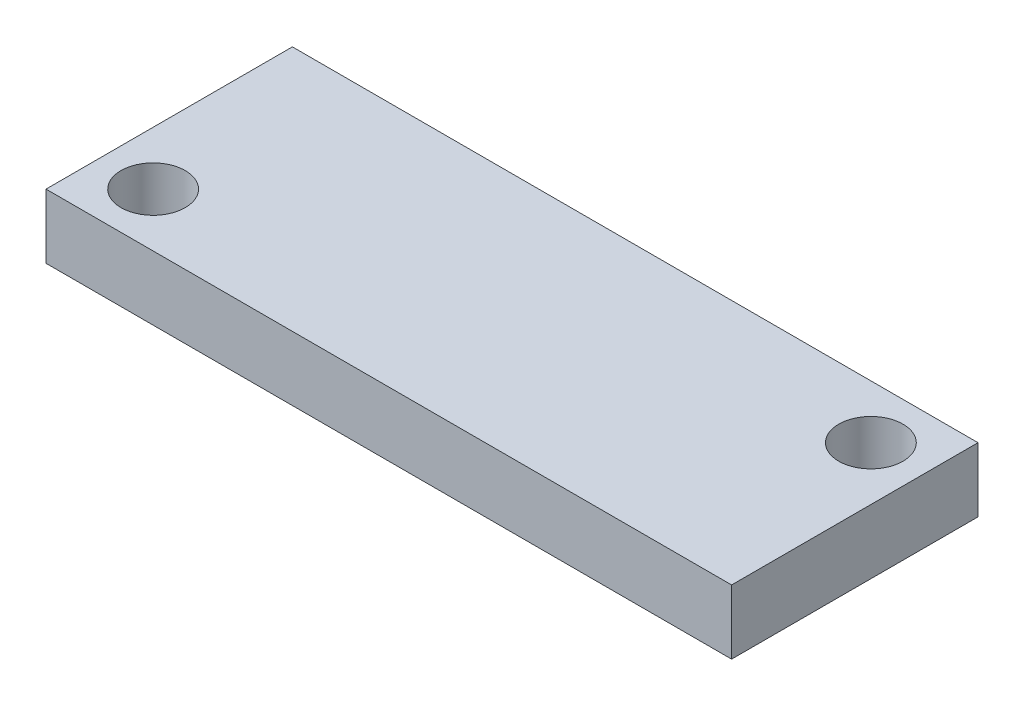
ISO-10303-21;
HEADER;
FILE_DESCRIPTION(('STEP AP214'),'2;1');
FILE_NAME('part.step','',(''),(''),'','','');
FILE_SCHEMA(('AUTOMOTIVE_DESIGN { 1 0 10303 214 1 1 1 1 }'));
ENDSEC;
DATA;
#1=APPLICATION_CONTEXT('core data for automotive mechanical design processes');
#2=APPLICATION_PROTOCOL_DEFINITION('international standard','automotive_design',2000,#1);
#3=PRODUCT_CONTEXT('',#1,'mechanical');
#4=PRODUCT('Part','Part','',(#3));
#5=PRODUCT_RELATED_PRODUCT_CATEGORY('part','',(#4));
#6=PRODUCT_DEFINITION_FORMATION('','',#4);
#7=PRODUCT_DEFINITION_CONTEXT('part definition',#1,'design');
#8=PRODUCT_DEFINITION('design','',#6,#7);
#9=PRODUCT_DEFINITION_SHAPE('','',#8);
#10=(LENGTH_UNIT() NAMED_UNIT(*) SI_UNIT(.MILLI.,.METRE.));
#11=(NAMED_UNIT(*) PLANE_ANGLE_UNIT() SI_UNIT($,.RADIAN.));
#12=(NAMED_UNIT(*) SI_UNIT($,.STERADIAN.) SOLID_ANGLE_UNIT());
#13=UNCERTAINTY_MEASURE_WITH_UNIT(LENGTH_MEASURE(1.E-05),#10,'distance_accuracy_value','');
#14=(GEOMETRIC_REPRESENTATION_CONTEXT(3) GLOBAL_UNCERTAINTY_ASSIGNED_CONTEXT((#13)) GLOBAL_UNIT_ASSIGNED_CONTEXT((#10,
#11,#12)) REPRESENTATION_CONTEXT('',''));
#15=CARTESIAN_POINT('',(0.,0.,0.));
#16=DIRECTION('',(0.,0.,1.));
#17=DIRECTION('',(1.,0.,0.));
#18=AXIS2_PLACEMENT_3D('',#15,#16,#17);
#19=CARTESIAN_POINT('',(0.,3.,0.));
#20=DIRECTION('',(0.,-1.,0.));
#21=DIRECTION('',(0.,0.,-1.));
#22=AXIS2_PLACEMENT_3D('',#19,#20,#21);
#23=PLANE('',#22);
#24=CARTESIAN_POINT('',(2.5,3.,-2.5));
#25=DIRECTION('',(0.,1.,0.));
#26=DIRECTION('',(0.,0.,1.));
#27=AXIS2_PLACEMENT_3D('',#24,#25,#26);
#28=CIRCLE('',#27,1.5);
#29=CARTESIAN_POINT('',(2.5,3.,-1.));
#30=VERTEX_POINT('',#29);
#31=EDGE_CURVE('E100',#30,#30,#28,.T.);
#32=ORIENTED_EDGE('',*,*,#31,.F.);
#33=EDGE_LOOP('',(#32));
#34=FACE_BOUND('',#33,.T.);
#35=DIRECTION('',(0.,0.,1.));
#36=VECTOR('',#35,1.);
#37=CARTESIAN_POINT('',(0.,3.,0.));
#38=LINE('',#37,#36);
#39=CARTESIAN_POINT('',(0.,3.,-11.5));
#40=VERTEX_POINT('',#39);
#41=CARTESIAN_POINT('',(0.,3.,0.));
#42=VERTEX_POINT('',#41);
#43=EDGE_CURVE('E85',#40,#42,#38,.T.);
#44=ORIENTED_EDGE('',*,*,#43,.T.);
#45=DIRECTION('',(1.,0.,0.));
#46=VECTOR('',#45,1.);
#47=CARTESIAN_POINT('',(0.,3.,0.));
#48=LINE('',#47,#46);
#49=CARTESIAN_POINT('',(32.,3.,0.));
#50=VERTEX_POINT('',#49);
#51=EDGE_CURVE('E80',#42,#50,#48,.T.);
#52=ORIENTED_EDGE('',*,*,#51,.T.);
#53=DIRECTION('',(0.,0.,-1.));
#54=VECTOR('',#53,1.);
#55=CARTESIAN_POINT('',(32.,3.,-11.5));
#56=LINE('',#55,#54);
#57=CARTESIAN_POINT('',(32.,3.,-11.5));
#58=VERTEX_POINT('',#57);
#59=EDGE_CURVE('E83',#50,#58,#56,.T.);
#60=ORIENTED_EDGE('',*,*,#59,.T.);
#61=DIRECTION('',(-1.,0.,0.));
#62=VECTOR('',#61,1.);
#63=CARTESIAN_POINT('',(0.,3.,-11.5));
#64=LINE('',#63,#62);
#65=EDGE_CURVE('E50',#58,#40,#64,.T.);
#66=ORIENTED_EDGE('',*,*,#65,.T.);
#67=EDGE_LOOP('',(#44,#52,#60,#66));
#68=FACE_BOUND('',#67,.T.);
#69=CARTESIAN_POINT('',(29.5,3.,-9.));
#70=DIRECTION('',(0.,1.,0.));
#71=DIRECTION('',(0.,0.,1.));
#72=AXIS2_PLACEMENT_3D('',#69,#70,#71);
#73=CIRCLE('',#72,1.5);
#74=CARTESIAN_POINT('',(29.5,3.,-7.5));
#75=VERTEX_POINT('',#74);
#76=EDGE_CURVE('E115',#75,#75,#73,.T.);
#77=ORIENTED_EDGE('',*,*,#76,.F.);
#78=EDGE_LOOP('',(#77));
#79=FACE_BOUND('',#78,.T.);
#80=ADVANCED_FACE('F33',(#34,#68,#79),#23,.F.);
#81=CARTESIAN_POINT('',(0.,0.,0.));
#82=DIRECTION('',(0.,-1.,0.));
#83=DIRECTION('',(0.,0.,-1.));
#84=AXIS2_PLACEMENT_3D('',#81,#82,#83);
#85=PLANE('',#84);
#86=CARTESIAN_POINT('',(2.5,0.,-2.5));
#87=DIRECTION('',(0.,1.,0.));
#88=DIRECTION('',(0.,0.,1.));
#89=AXIS2_PLACEMENT_3D('',#86,#87,#88);
#90=CIRCLE('',#89,1.5);
#91=CARTESIAN_POINT('',(2.5,0.,-1.));
#92=VERTEX_POINT('',#91);
#93=EDGE_CURVE('E112',#92,#92,#90,.T.);
#94=ORIENTED_EDGE('',*,*,#93,.T.);
#95=EDGE_LOOP('',(#94));
#96=FACE_BOUND('',#95,.T.);
#97=DIRECTION('',(0.,0.,1.));
#98=VECTOR('',#97,1.);
#99=CARTESIAN_POINT('',(0.,0.,0.));
#100=LINE('',#99,#98);
#101=CARTESIAN_POINT('',(0.,0.,-11.5));
#102=VERTEX_POINT('',#101);
#103=CARTESIAN_POINT('',(0.,0.,0.));
#104=VERTEX_POINT('',#103);
#105=EDGE_CURVE('E97',#102,#104,#100,.T.);
#106=ORIENTED_EDGE('',*,*,#105,.F.);
#107=DIRECTION('',(-1.,0.,0.));
#108=VECTOR('',#107,1.);
#109=CARTESIAN_POINT('',(0.,0.,-11.5));
#110=LINE('',#109,#108);
#111=CARTESIAN_POINT('',(32.,0.,-11.5));
#112=VERTEX_POINT('',#111);
#113=EDGE_CURVE('E73',#112,#102,#110,.T.);
#114=ORIENTED_EDGE('',*,*,#113,.F.);
#115=DIRECTION('',(0.,0.,-1.));
#116=VECTOR('',#115,1.);
#117=CARTESIAN_POINT('',(32.,0.,-11.5));
#118=LINE('',#117,#116);
#119=CARTESIAN_POINT('',(32.,0.,0.));
#120=VERTEX_POINT('',#119);
#121=EDGE_CURVE('E67',#120,#112,#118,.T.);
#122=ORIENTED_EDGE('',*,*,#121,.F.);
#123=DIRECTION('',(1.,0.,0.));
#124=VECTOR('',#123,1.);
#125=CARTESIAN_POINT('',(0.,0.,0.));
#126=LINE('',#125,#124);
#127=EDGE_CURVE('E89',#104,#120,#126,.T.);
#128=ORIENTED_EDGE('',*,*,#127,.F.);
#129=EDGE_LOOP('',(#106,#114,#122,#128));
#130=FACE_BOUND('',#129,.T.);
#131=CARTESIAN_POINT('',(29.5,0.,-9.));
#132=DIRECTION('',(0.,1.,0.));
#133=DIRECTION('',(0.,0.,1.));
#134=AXIS2_PLACEMENT_3D('',#131,#132,#133);
#135=CIRCLE('',#134,1.5);
#136=CARTESIAN_POINT('',(29.5,0.,-7.5));
#137=VERTEX_POINT('',#136);
#138=EDGE_CURVE('E118',#137,#137,#135,.T.);
#139=ORIENTED_EDGE('',*,*,#138,.T.);
#140=EDGE_LOOP('',(#139));
#141=FACE_BOUND('',#140,.T.);
#142=ADVANCED_FACE('F108',(#96,#130,#141),#85,.T.);
#143=CARTESIAN_POINT('',(0.,3.,0.));
#144=DIRECTION('',(1.,0.,0.));
#145=DIRECTION('',(0.,0.,-1.));
#146=AXIS2_PLACEMENT_3D('',#143,#144,#145);
#147=PLANE('',#146);
#148=ORIENTED_EDGE('',*,*,#105,.T.);
#149=DIRECTION('',(0.,-1.,0.));
#150=VECTOR('',#149,1.);
#151=CARTESIAN_POINT('',(0.,3.,0.));
#152=LINE('',#151,#150);
#153=EDGE_CURVE('E11',#42,#104,#152,.T.);
#154=ORIENTED_EDGE('',*,*,#153,.F.);
#155=ORIENTED_EDGE('',*,*,#43,.F.);
#156=DIRECTION('',(0.,-1.,0.));
#157=VECTOR('',#156,1.);
#158=CARTESIAN_POINT('',(0.,3.,-11.5));
#159=LINE('',#158,#157);
#160=EDGE_CURVE('E93',#40,#102,#159,.T.);
#161=ORIENTED_EDGE('',*,*,#160,.T.);
#162=EDGE_LOOP('',(#148,#154,#155,#161));
#163=FACE_BOUND('',#162,.T.);
#164=ADVANCED_FACE('F35',(#163),#147,.F.);
#165=CARTESIAN_POINT('',(0.,3.,0.));
#166=DIRECTION('',(0.,0.,-1.));
#167=DIRECTION('',(-1.,0.,0.));
#168=AXIS2_PLACEMENT_3D('',#165,#166,#167);
#169=PLANE('',#168);
#170=ORIENTED_EDGE('',*,*,#127,.T.);
#171=DIRECTION('',(0.,-1.,0.));
#172=VECTOR('',#171,1.);
#173=CARTESIAN_POINT('',(32.,3.,0.));
#174=LINE('',#173,#172);
#175=EDGE_CURVE('E42',#50,#120,#174,.T.);
#176=ORIENTED_EDGE('',*,*,#175,.F.);
#177=ORIENTED_EDGE('',*,*,#51,.F.);
#178=ORIENTED_EDGE('',*,*,#153,.T.);
#179=EDGE_LOOP('',(#170,#176,#177,#178));
#180=FACE_BOUND('',#179,.T.);
#181=ADVANCED_FACE('F88',(#180),#169,.F.);
#182=CARTESIAN_POINT('',(32.,3.,-11.5));
#183=DIRECTION('',(-1.,0.,0.));
#184=DIRECTION('',(0.,0.,1.));
#185=AXIS2_PLACEMENT_3D('',#182,#183,#184);
#186=PLANE('',#185);
#187=ORIENTED_EDGE('',*,*,#121,.T.);
#188=DIRECTION('',(0.,-1.,0.));
#189=VECTOR('',#188,1.);
#190=CARTESIAN_POINT('',(32.,3.,-11.5));
#191=LINE('',#190,#189);
#192=EDGE_CURVE('E90',#58,#112,#191,.T.);
#193=ORIENTED_EDGE('',*,*,#192,.F.);
#194=ORIENTED_EDGE('',*,*,#59,.F.);
#195=ORIENTED_EDGE('',*,*,#175,.T.);
#196=EDGE_LOOP('',(#187,#193,#194,#195));
#197=FACE_BOUND('',#196,.T.);
#198=ADVANCED_FACE('F91',(#197),#186,.F.);
#199=CARTESIAN_POINT('',(0.,3.,-11.5));
#200=DIRECTION('',(0.,0.,1.));
#201=DIRECTION('',(1.,0.,0.));
#202=AXIS2_PLACEMENT_3D('',#199,#200,#201);
#203=PLANE('',#202);
#204=ORIENTED_EDGE('',*,*,#113,.T.);
#205=ORIENTED_EDGE('',*,*,#160,.F.);
#206=ORIENTED_EDGE('',*,*,#65,.F.);
#207=ORIENTED_EDGE('',*,*,#192,.T.);
#208=EDGE_LOOP('',(#204,#205,#206,#207));
#209=FACE_BOUND('',#208,.T.);
#210=ADVANCED_FACE('F105',(#209),#203,.F.);
#211=CARTESIAN_POINT('',(2.5,3.,-2.5));
#212=DIRECTION('',(0.,-1.,0.));
#213=DIRECTION('',(0.,0.,-1.));
#214=AXIS2_PLACEMENT_3D('',#211,#212,#213);
#215=CYLINDRICAL_SURFACE('',#214,1.5);
#216=ORIENTED_EDGE('',*,*,#31,.T.);
#217=EDGE_LOOP('',(#216));
#218=FACE_BOUND('',#217,.T.);
#219=ORIENTED_EDGE('',*,*,#93,.F.);
#220=EDGE_LOOP('',(#219));
#221=FACE_BOUND('',#220,.T.);
#222=ADVANCED_FACE('F136',(#218,#221),#215,.F.);
#223=CARTESIAN_POINT('',(29.5,3.,-9.));
#224=DIRECTION('',(0.,-1.,0.));
#225=DIRECTION('',(0.,0.,-1.));
#226=AXIS2_PLACEMENT_3D('',#223,#224,#225);
#227=CYLINDRICAL_SURFACE('',#226,1.5);
#228=ORIENTED_EDGE('',*,*,#76,.T.);
#229=EDGE_LOOP('',(#228));
#230=FACE_BOUND('',#229,.T.);
#231=ORIENTED_EDGE('',*,*,#138,.F.);
#232=EDGE_LOOP('',(#231));
#233=FACE_BOUND('',#232,.T.);
#234=ADVANCED_FACE('F124',(#230,#233),#227,.F.);
#235=CLOSED_SHELL('',(#80,#142,#164,#181,#198,#210,#222,#234));
#236=MANIFOLD_SOLID_BREP('B2',#235);
#237=ADVANCED_BREP_SHAPE_REPRESENTATION('',(#18,#236),#14);
#238=SHAPE_DEFINITION_REPRESENTATION(#9,#237);
ENDSEC;
END-ISO-10303-21;
